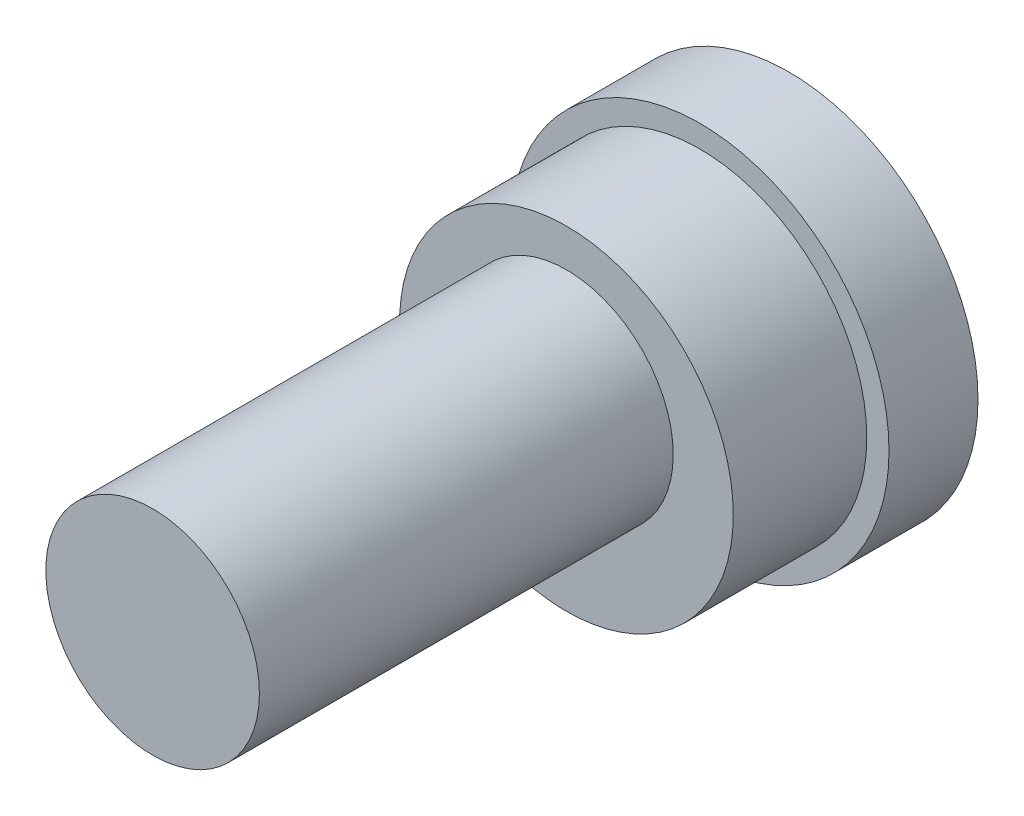
ISO-10303-21;
HEADER;
FILE_DESCRIPTION(('STEP AP214'),'2;1');
FILE_NAME('part.step','',(''),(''),'','','');
FILE_SCHEMA(('AUTOMOTIVE_DESIGN { 1 0 10303 214 1 1 1 1 }'));
ENDSEC;
DATA;
#1=APPLICATION_CONTEXT('core data for automotive mechanical design processes');
#2=APPLICATION_PROTOCOL_DEFINITION('international standard','automotive_design',2000,#1);
#3=PRODUCT_CONTEXT('',#1,'mechanical');
#4=PRODUCT('Part','Part','',(#3));
#5=PRODUCT_RELATED_PRODUCT_CATEGORY('part','',(#4));
#6=PRODUCT_DEFINITION_FORMATION('','',#4);
#7=PRODUCT_DEFINITION_CONTEXT('part definition',#1,'design');
#8=PRODUCT_DEFINITION('design','',#6,#7);
#9=PRODUCT_DEFINITION_SHAPE('','',#8);
#10=(LENGTH_UNIT() NAMED_UNIT(*) SI_UNIT(.MILLI.,.METRE.));
#11=(NAMED_UNIT(*) PLANE_ANGLE_UNIT() SI_UNIT($,.RADIAN.));
#12=(NAMED_UNIT(*) SI_UNIT($,.STERADIAN.) SOLID_ANGLE_UNIT());
#13=UNCERTAINTY_MEASURE_WITH_UNIT(LENGTH_MEASURE(1.E-05),#10,'distance_accuracy_value','');
#14=(GEOMETRIC_REPRESENTATION_CONTEXT(3) GLOBAL_UNCERTAINTY_ASSIGNED_CONTEXT((#13)) GLOBAL_UNIT_ASSIGNED_CONTEXT((#10,
#11,#12)) REPRESENTATION_CONTEXT('',''));
#15=CARTESIAN_POINT('',(0.,0.,0.));
#16=DIRECTION('',(0.,0.,1.));
#17=DIRECTION('',(1.,0.,0.));
#18=AXIS2_PLACEMENT_3D('',#15,#16,#17);
#19=CARTESIAN_POINT('',(0.,0.,20.));
#20=DIRECTION('',(0.,0.,-1.));
#21=DIRECTION('',(-1.,0.,0.));
#22=AXIS2_PLACEMENT_3D('',#19,#20,#21);
#23=CYLINDRICAL_SURFACE('',#22,42.5);
#24=CARTESIAN_POINT('',(0.,0.,20.));
#25=DIRECTION('',(0.,0.,1.));
#26=DIRECTION('',(1.,0.,0.));
#27=AXIS2_PLACEMENT_3D('',#24,#25,#26);
#28=CIRCLE('',#27,42.5);
#29=CARTESIAN_POINT('',(42.5,0.,20.));
#30=VERTEX_POINT('',#29);
#31=EDGE_CURVE('E45',#30,#30,#28,.T.);
#32=ORIENTED_EDGE('',*,*,#31,.F.);
#33=EDGE_LOOP('',(#32));
#34=FACE_BOUND('',#33,.T.);
#35=CARTESIAN_POINT('',(0.,0.,0.));
#36=DIRECTION('',(0.,0.,1.));
#37=DIRECTION('',(1.,0.,0.));
#38=AXIS2_PLACEMENT_3D('',#35,#36,#37);
#39=CIRCLE('',#38,42.5);
#40=CARTESIAN_POINT('',(42.5,0.,0.));
#41=VERTEX_POINT('',#40);
#42=EDGE_CURVE('E36',#41,#41,#39,.T.);
#43=ORIENTED_EDGE('',*,*,#42,.T.);
#44=EDGE_LOOP('',(#43));
#45=FACE_BOUND('',#44,.T.);
#46=ADVANCED_FACE('F33',(#34,#45),#23,.T.);
#47=CARTESIAN_POINT('',(0.,0.,20.));
#48=DIRECTION('',(0.,0.,1.));
#49=DIRECTION('',(1.,0.,0.));
#50=AXIS2_PLACEMENT_3D('',#47,#48,#49);
#51=PLANE('',#50);
#52=CARTESIAN_POINT('',(0.,0.,20.));
#53=DIRECTION('',(0.,0.,1.));
#54=DIRECTION('',(1.,0.,0.));
#55=AXIS2_PLACEMENT_3D('',#52,#53,#54);
#56=CIRCLE('',#55,37.5);
#57=CARTESIAN_POINT('',(37.5,0.,20.));
#58=VERTEX_POINT('',#57);
#59=EDGE_CURVE('E40',#58,#58,#56,.T.);
#60=ORIENTED_EDGE('',*,*,#59,.F.);
#61=EDGE_LOOP('',(#60));
#62=FACE_BOUND('',#61,.T.);
#63=ORIENTED_EDGE('',*,*,#31,.T.);
#64=EDGE_LOOP('',(#63));
#65=FACE_BOUND('',#64,.T.);
#66=ADVANCED_FACE('F62',(#62,#65),#51,.T.);
#67=CARTESIAN_POINT('',(0.,0.,0.));
#68=DIRECTION('',(0.,0.,1.));
#69=DIRECTION('',(1.,0.,0.));
#70=AXIS2_PLACEMENT_3D('',#67,#68,#69);
#71=PLANE('',#70);
#72=ORIENTED_EDGE('',*,*,#42,.F.);
#73=EDGE_LOOP('',(#72));
#74=FACE_BOUND('',#73,.T.);
#75=ADVANCED_FACE('F59',(#74),#71,.F.);
#76=CARTESIAN_POINT('',(0.,0.,50.));
#77=DIRECTION('',(0.,0.,-1.));
#78=DIRECTION('',(-1.,0.,0.));
#79=AXIS2_PLACEMENT_3D('',#76,#77,#78);
#80=CYLINDRICAL_SURFACE('',#79,37.5);
#81=CARTESIAN_POINT('',(0.,0.,50.));
#82=DIRECTION('',(0.,0.,1.));
#83=DIRECTION('',(1.,0.,0.));
#84=AXIS2_PLACEMENT_3D('',#81,#82,#83);
#85=CIRCLE('',#84,37.5);
#86=CARTESIAN_POINT('',(37.5,0.,50.));
#87=VERTEX_POINT('',#86);
#88=EDGE_CURVE('E50',#87,#87,#85,.T.);
#89=ORIENTED_EDGE('',*,*,#88,.F.);
#90=EDGE_LOOP('',(#89));
#91=FACE_BOUND('',#90,.T.);
#92=ORIENTED_EDGE('',*,*,#59,.T.);
#93=EDGE_LOOP('',(#92));
#94=FACE_BOUND('',#93,.T.);
#95=ADVANCED_FACE('F61',(#91,#94),#80,.T.);
#96=CARTESIAN_POINT('',(0.,0.,50.));
#97=DIRECTION('',(0.,0.,1.));
#98=DIRECTION('',(1.,0.,0.));
#99=AXIS2_PLACEMENT_3D('',#96,#97,#98);
#100=PLANE('',#99);
#101=CARTESIAN_POINT('',(0.,5.00000000000001,50.));
#102=DIRECTION('',(0.,0.,1.));
#103=DIRECTION('',(1.,0.,0.));
#104=AXIS2_PLACEMENT_3D('',#101,#102,#103);
#105=CIRCLE('',#104,24.);
#106=CARTESIAN_POINT('',(24.,5.00000000000001,50.));
#107=VERTEX_POINT('',#106);
#108=EDGE_CURVE('E10',#107,#107,#105,.T.);
#109=ORIENTED_EDGE('',*,*,#108,.F.);
#110=EDGE_LOOP('',(#109));
#111=FACE_BOUND('',#110,.T.);
#112=ORIENTED_EDGE('',*,*,#88,.T.);
#113=EDGE_LOOP('',(#112));
#114=FACE_BOUND('',#113,.T.);
#115=ADVANCED_FACE('F67',(#111,#114),#100,.T.);
#116=CARTESIAN_POINT('',(0.,5.00000000000001,143.));
#117=DIRECTION('',(0.,0.,-1.));
#118=DIRECTION('',(-1.,0.,0.));
#119=AXIS2_PLACEMENT_3D('',#116,#117,#118);
#120=CYLINDRICAL_SURFACE('',#119,24.);
#121=CARTESIAN_POINT('',(0.,5.00000000000001,143.));
#122=DIRECTION('',(0.,0.,1.));
#123=DIRECTION('',(1.,0.,0.));
#124=AXIS2_PLACEMENT_3D('',#121,#122,#123);
#125=CIRCLE('',#124,24.);
#126=CARTESIAN_POINT('',(24.,5.00000000000001,143.));
#127=VERTEX_POINT('',#126);
#128=EDGE_CURVE('E49',#127,#127,#125,.T.);
#129=ORIENTED_EDGE('',*,*,#128,.F.);
#130=EDGE_LOOP('',(#129));
#131=FACE_BOUND('',#130,.T.);
#132=ORIENTED_EDGE('',*,*,#108,.T.);
#133=EDGE_LOOP('',(#132));
#134=FACE_BOUND('',#133,.T.);
#135=ADVANCED_FACE('F97',(#131,#134),#120,.T.);
#136=CARTESIAN_POINT('',(0.,5.00000000000001,143.));
#137=DIRECTION('',(0.,0.,1.));
#138=DIRECTION('',(1.,0.,0.));
#139=AXIS2_PLACEMENT_3D('',#136,#137,#138);
#140=PLANE('',#139);
#141=ORIENTED_EDGE('',*,*,#128,.T.);
#142=EDGE_LOOP('',(#141));
#143=FACE_BOUND('',#142,.T.);
#144=ADVANCED_FACE('F107',(#143),#140,.T.);
#145=CLOSED_SHELL('',(#46,#66,#75,#95,#115,#135,#144));
#146=MANIFOLD_SOLID_BREP('B2',#145);
#147=ADVANCED_BREP_SHAPE_REPRESENTATION('',(#18,#146),#14);
#148=SHAPE_DEFINITION_REPRESENTATION(#9,#147);
ENDSEC;
END-ISO-10303-21;
